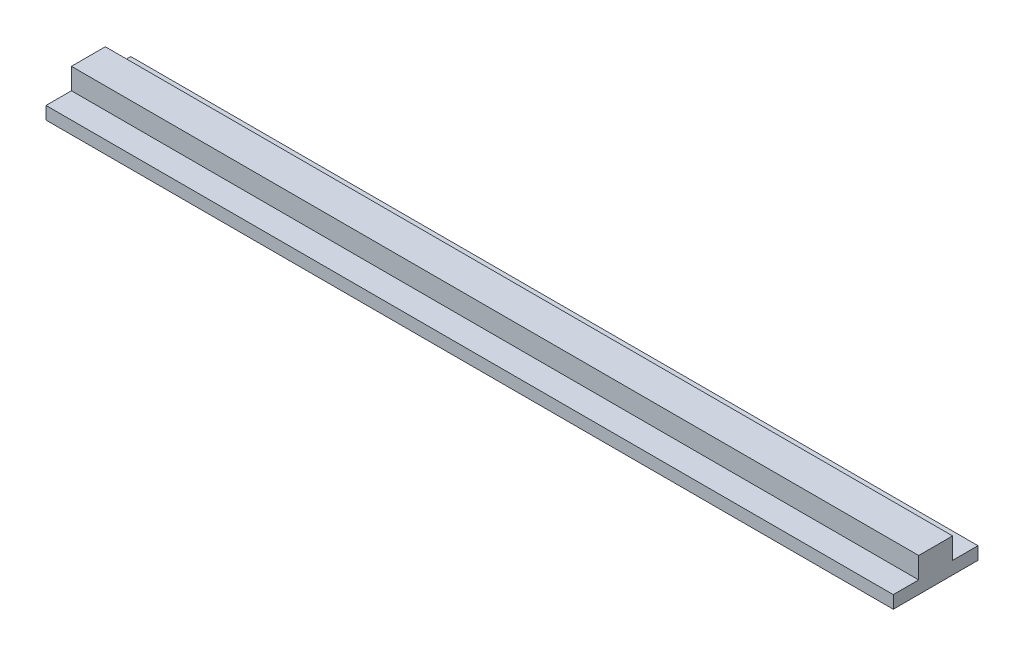
ISO-10303-21;
HEADER;
FILE_DESCRIPTION(('STEP AP214'),'2;1');
FILE_NAME('part.step','',(''),(''),'','','');
FILE_SCHEMA(('AUTOMOTIVE_DESIGN { 1 0 10303 214 1 1 1 1 }'));
ENDSEC;
DATA;
#1=APPLICATION_CONTEXT('core data for automotive mechanical design processes');
#2=APPLICATION_PROTOCOL_DEFINITION('international standard','automotive_design',2000,#1);
#3=PRODUCT_CONTEXT('',#1,'mechanical');
#4=PRODUCT('Part','Part','',(#3));
#5=PRODUCT_RELATED_PRODUCT_CATEGORY('part','',(#4));
#6=PRODUCT_DEFINITION_FORMATION('','',#4);
#7=PRODUCT_DEFINITION_CONTEXT('part definition',#1,'design');
#8=PRODUCT_DEFINITION('design','',#6,#7);
#9=PRODUCT_DEFINITION_SHAPE('','',#8);
#10=(LENGTH_UNIT() NAMED_UNIT(*) SI_UNIT(.MILLI.,.METRE.));
#11=(NAMED_UNIT(*) PLANE_ANGLE_UNIT() SI_UNIT($,.RADIAN.));
#12=(NAMED_UNIT(*) SI_UNIT($,.STERADIAN.) SOLID_ANGLE_UNIT());
#13=UNCERTAINTY_MEASURE_WITH_UNIT(LENGTH_MEASURE(1.E-05),#10,'distance_accuracy_value','');
#14=(GEOMETRIC_REPRESENTATION_CONTEXT(3) GLOBAL_UNCERTAINTY_ASSIGNED_CONTEXT((#13)) GLOBAL_UNIT_ASSIGNED_CONTEXT((#10,
#11,#12)) REPRESENTATION_CONTEXT('',''));
#15=CARTESIAN_POINT('',(0.,0.,0.));
#16=DIRECTION('',(0.,0.,1.));
#17=DIRECTION('',(1.,0.,0.));
#18=AXIS2_PLACEMENT_3D('',#15,#16,#17);
#19=CARTESIAN_POINT('',(1000.,30.,40.));
#20=DIRECTION('',(0.,-1.,0.));
#21=DIRECTION('',(0.,0.,-1.));
#22=AXIS2_PLACEMENT_3D('',#19,#20,#21);
#23=PLANE('',#22);
#24=DIRECTION('',(0.,0.,1.));
#25=VECTOR('',#24,1.);
#26=CARTESIAN_POINT('',(-1000.,30.,40.));
#27=LINE('',#26,#25);
#28=CARTESIAN_POINT('',(-1000.,30.,40.));
#29=VERTEX_POINT('',#28);
#30=CARTESIAN_POINT('',(-1000.,30.,100.));
#31=VERTEX_POINT('',#30);
#32=EDGE_CURVE('E132',#29,#31,#27,.T.);
#33=ORIENTED_EDGE('',*,*,#32,.T.);
#34=DIRECTION('',(-1.,0.,0.));
#35=VECTOR('',#34,1.);
#36=CARTESIAN_POINT('',(1000.,30.,100.));
#37=LINE('',#36,#35);
#38=CARTESIAN_POINT('',(1000.,30.,100.));
#39=VERTEX_POINT('',#38);
#40=EDGE_CURVE('E43',#39,#31,#37,.T.);
#41=ORIENTED_EDGE('',*,*,#40,.F.);
#42=DIRECTION('',(0.,0.,1.));
#43=VECTOR('',#42,1.);
#44=CARTESIAN_POINT('',(1000.,30.,40.));
#45=LINE('',#44,#43);
#46=CARTESIAN_POINT('',(1000.,30.,40.));
#47=VERTEX_POINT('',#46);
#48=EDGE_CURVE('E147',#47,#39,#45,.T.);
#49=ORIENTED_EDGE('',*,*,#48,.F.);
#50=DIRECTION('',(-1.,0.,0.));
#51=VECTOR('',#50,1.);
#52=CARTESIAN_POINT('',(1000.,30.,40.));
#53=LINE('',#52,#51);
#54=EDGE_CURVE('E128',#47,#29,#53,.T.);
#55=ORIENTED_EDGE('',*,*,#54,.T.);
#56=EDGE_LOOP('',(#33,#41,#49,#55));
#57=FACE_BOUND('',#56,.T.);
#58=ADVANCED_FACE('F35',(#57),#23,.F.);
#59=CARTESIAN_POINT('',(1000.,30.,100.));
#60=DIRECTION('',(0.,0.,-1.));
#61=DIRECTION('',(-1.,0.,0.));
#62=AXIS2_PLACEMENT_3D('',#59,#60,#61);
#63=PLANE('',#62);
#64=DIRECTION('',(0.,-1.,0.));
#65=VECTOR('',#64,1.);
#66=CARTESIAN_POINT('',(-1000.,30.,100.));
#67=LINE('',#66,#65);
#68=CARTESIAN_POINT('',(-1000.,0.,100.));
#69=VERTEX_POINT('',#68);
#70=EDGE_CURVE('E135',#31,#69,#67,.T.);
#71=ORIENTED_EDGE('',*,*,#70,.T.);
#72=DIRECTION('',(-1.,0.,0.));
#73=VECTOR('',#72,1.);
#74=CARTESIAN_POINT('',(1000.,0.,100.));
#75=LINE('',#74,#73);
#76=CARTESIAN_POINT('',(1000.,0.,100.));
#77=VERTEX_POINT('',#76);
#78=EDGE_CURVE('E157',#77,#69,#75,.T.);
#79=ORIENTED_EDGE('',*,*,#78,.F.);
#80=DIRECTION('',(0.,-1.,0.));
#81=VECTOR('',#80,1.);
#82=CARTESIAN_POINT('',(1000.,30.,100.));
#83=LINE('',#82,#81);
#84=EDGE_CURVE('E95',#39,#77,#83,.T.);
#85=ORIENTED_EDGE('',*,*,#84,.F.);
#86=ORIENTED_EDGE('',*,*,#40,.T.);
#87=EDGE_LOOP('',(#71,#79,#85,#86));
#88=FACE_BOUND('',#87,.T.);
#89=ADVANCED_FACE('F160',(#88),#63,.F.);
#90=CARTESIAN_POINT('',(1000.,0.,-100.));
#91=DIRECTION('',(0.,1.,0.));
#92=DIRECTION('',(0.,0.,1.));
#93=AXIS2_PLACEMENT_3D('',#90,#91,#92);
#94=PLANE('',#93);
#95=CARTESIAN_POINT('',(0.,0.,0.));
#96=DIRECTION('',(0.,1.,0.));
#97=DIRECTION('',(0.,0.,1.));
#98=AXIS2_PLACEMENT_3D('',#95,#96,#97);
#99=CIRCLE('',#98,20.);
#100=CARTESIAN_POINT('',(0.,0.,20.));
#101=VERTEX_POINT('',#100);
#102=EDGE_CURVE('E11',#101,#101,#99,.F.);
#103=ORIENTED_EDGE('',*,*,#102,.F.);
#104=EDGE_LOOP('',(#103));
#105=FACE_BOUND('',#104,.T.);
#106=DIRECTION('',(0.,0.,-1.));
#107=VECTOR('',#106,1.);
#108=CARTESIAN_POINT('',(-1000.,0.,-100.));
#109=LINE('',#108,#107);
#110=CARTESIAN_POINT('',(-1000.,0.,-100.));
#111=VERTEX_POINT('',#110);
#112=EDGE_CURVE('E138',#69,#111,#109,.T.);
#113=ORIENTED_EDGE('',*,*,#112,.T.);
#114=DIRECTION('',(-1.,0.,0.));
#115=VECTOR('',#114,1.);
#116=CARTESIAN_POINT('',(1000.,0.,-100.));
#117=LINE('',#116,#115);
#118=CARTESIAN_POINT('',(1000.,0.,-100.));
#119=VERTEX_POINT('',#118);
#120=EDGE_CURVE('E154',#119,#111,#117,.T.);
#121=ORIENTED_EDGE('',*,*,#120,.F.);
#122=DIRECTION('',(0.,0.,-1.));
#123=VECTOR('',#122,1.);
#124=CARTESIAN_POINT('',(1000.,0.,-100.));
#125=LINE('',#124,#123);
#126=EDGE_CURVE('E178',#77,#119,#125,.T.);
#127=ORIENTED_EDGE('',*,*,#126,.F.);
#128=ORIENTED_EDGE('',*,*,#78,.T.);
#129=EDGE_LOOP('',(#113,#121,#127,#128));
#130=FACE_BOUND('',#129,.T.);
#131=ADVANCED_FACE('F171',(#105,#130),#94,.F.);
#132=CARTESIAN_POINT('',(1000.,30.,-100.));
#133=DIRECTION('',(0.,0.,1.));
#134=DIRECTION('',(1.,0.,0.));
#135=AXIS2_PLACEMENT_3D('',#132,#133,#134);
#136=PLANE('',#135);
#137=DIRECTION('',(0.,1.,0.));
#138=VECTOR('',#137,1.);
#139=CARTESIAN_POINT('',(-1000.,30.,-100.));
#140=LINE('',#139,#138);
#141=CARTESIAN_POINT('',(-1000.,30.,-100.));
#142=VERTEX_POINT('',#141);
#143=EDGE_CURVE('E140',#111,#142,#140,.T.);
#144=ORIENTED_EDGE('',*,*,#143,.T.);
#145=DIRECTION('',(-1.,0.,0.));
#146=VECTOR('',#145,1.);
#147=CARTESIAN_POINT('',(1000.,30.,-100.));
#148=LINE('',#147,#146);
#149=CARTESIAN_POINT('',(1000.,30.,-100.));
#150=VERTEX_POINT('',#149);
#151=EDGE_CURVE('E151',#150,#142,#148,.T.);
#152=ORIENTED_EDGE('',*,*,#151,.F.);
#153=DIRECTION('',(0.,1.,0.));
#154=VECTOR('',#153,1.);
#155=CARTESIAN_POINT('',(1000.,30.,-100.));
#156=LINE('',#155,#154);
#157=EDGE_CURVE('E177',#119,#150,#156,.T.);
#158=ORIENTED_EDGE('',*,*,#157,.F.);
#159=ORIENTED_EDGE('',*,*,#120,.T.);
#160=EDGE_LOOP('',(#144,#152,#158,#159));
#161=FACE_BOUND('',#160,.T.);
#162=ADVANCED_FACE('F175',(#161),#136,.F.);
#163=CARTESIAN_POINT('',(1000.,30.,-40.));
#164=DIRECTION('',(0.,-1.,0.));
#165=DIRECTION('',(0.,0.,-1.));
#166=AXIS2_PLACEMENT_3D('',#163,#164,#165);
#167=PLANE('',#166);
#168=DIRECTION('',(0.,0.,1.));
#169=VECTOR('',#168,1.);
#170=CARTESIAN_POINT('',(-1000.,30.,-40.));
#171=LINE('',#170,#169);
#172=CARTESIAN_POINT('',(-1000.,30.,-40.));
#173=VERTEX_POINT('',#172);
#174=EDGE_CURVE('E142',#142,#173,#171,.T.);
#175=ORIENTED_EDGE('',*,*,#174,.T.);
#176=DIRECTION('',(-1.,0.,0.));
#177=VECTOR('',#176,1.);
#178=CARTESIAN_POINT('',(1000.,30.,-40.));
#179=LINE('',#178,#177);
#180=CARTESIAN_POINT('',(1000.,30.,-40.));
#181=VERTEX_POINT('',#180);
#182=EDGE_CURVE('E123',#181,#173,#179,.T.);
#183=ORIENTED_EDGE('',*,*,#182,.F.);
#184=DIRECTION('',(0.,0.,1.));
#185=VECTOR('',#184,1.);
#186=CARTESIAN_POINT('',(1000.,30.,-40.));
#187=LINE('',#186,#185);
#188=EDGE_CURVE('E114',#150,#181,#187,.T.);
#189=ORIENTED_EDGE('',*,*,#188,.F.);
#190=ORIENTED_EDGE('',*,*,#151,.T.);
#191=EDGE_LOOP('',(#175,#183,#189,#190));
#192=FACE_BOUND('',#191,.T.);
#193=ADVANCED_FACE('F201',(#192),#167,.F.);
#194=CARTESIAN_POINT('',(1000.,80.,-40.));
#195=DIRECTION('',(0.,0.,1.));
#196=DIRECTION('',(1.,0.,0.));
#197=AXIS2_PLACEMENT_3D('',#194,#195,#196);
#198=PLANE('',#197);
#199=DIRECTION('',(0.,1.,0.));
#200=VECTOR('',#199,1.);
#201=CARTESIAN_POINT('',(-1000.,80.,-40.));
#202=LINE('',#201,#200);
#203=CARTESIAN_POINT('',(-1000.,80.,-40.));
#204=VERTEX_POINT('',#203);
#205=EDGE_CURVE('E122',#173,#204,#202,.T.);
#206=ORIENTED_EDGE('',*,*,#205,.T.);
#207=DIRECTION('',(-1.,0.,0.));
#208=VECTOR('',#207,1.);
#209=CARTESIAN_POINT('',(1000.,80.,-40.));
#210=LINE('',#209,#208);
#211=CARTESIAN_POINT('',(1000.,80.,-40.));
#212=VERTEX_POINT('',#211);
#213=EDGE_CURVE('E119',#212,#204,#210,.T.);
#214=ORIENTED_EDGE('',*,*,#213,.F.);
#215=DIRECTION('',(0.,1.,0.));
#216=VECTOR('',#215,1.);
#217=CARTESIAN_POINT('',(1000.,80.,-40.));
#218=LINE('',#217,#216);
#219=EDGE_CURVE('E108',#181,#212,#218,.T.);
#220=ORIENTED_EDGE('',*,*,#219,.F.);
#221=ORIENTED_EDGE('',*,*,#182,.T.);
#222=EDGE_LOOP('',(#206,#214,#220,#221));
#223=FACE_BOUND('',#222,.T.);
#224=ADVANCED_FACE('F120',(#223),#198,.F.);
#225=CARTESIAN_POINT('',(1000.,80.,40.));
#226=DIRECTION('',(0.,-1.,0.));
#227=DIRECTION('',(0.,0.,-1.));
#228=AXIS2_PLACEMENT_3D('',#225,#226,#227);
#229=PLANE('',#228);
#230=DIRECTION('',(0.,0.,1.));
#231=VECTOR('',#230,1.);
#232=CARTESIAN_POINT('',(-1000.,80.,40.));
#233=LINE('',#232,#231);
#234=CARTESIAN_POINT('',(-1000.,80.,40.));
#235=VERTEX_POINT('',#234);
#236=EDGE_CURVE('E80',#204,#235,#233,.T.);
#237=ORIENTED_EDGE('',*,*,#236,.T.);
#238=DIRECTION('',(-1.,0.,0.));
#239=VECTOR('',#238,1.);
#240=CARTESIAN_POINT('',(1000.,80.,40.));
#241=LINE('',#240,#239);
#242=CARTESIAN_POINT('',(1000.,80.,40.));
#243=VERTEX_POINT('',#242);
#244=EDGE_CURVE('E124',#243,#235,#241,.T.);
#245=ORIENTED_EDGE('',*,*,#244,.F.);
#246=DIRECTION('',(0.,0.,1.));
#247=VECTOR('',#246,1.);
#248=CARTESIAN_POINT('',(1000.,80.,40.));
#249=LINE('',#248,#247);
#250=EDGE_CURVE('E112',#212,#243,#249,.T.);
#251=ORIENTED_EDGE('',*,*,#250,.F.);
#252=ORIENTED_EDGE('',*,*,#213,.T.);
#253=EDGE_LOOP('',(#237,#245,#251,#252));
#254=FACE_BOUND('',#253,.T.);
#255=ADVANCED_FACE('F126',(#254),#229,.F.);
#256=CARTESIAN_POINT('',(1000.,80.,40.));
#257=DIRECTION('',(0.,0.,-1.));
#258=DIRECTION('',(-1.,0.,0.));
#259=AXIS2_PLACEMENT_3D('',#256,#257,#258);
#260=PLANE('',#259);
#261=DIRECTION('',(0.,-1.,0.));
#262=VECTOR('',#261,1.);
#263=CARTESIAN_POINT('',(-1000.,80.,40.));
#264=LINE('',#263,#262);
#265=EDGE_CURVE('E86',#235,#29,#264,.T.);
#266=ORIENTED_EDGE('',*,*,#265,.T.);
#267=ORIENTED_EDGE('',*,*,#54,.F.);
#268=DIRECTION('',(0.,-1.,0.));
#269=VECTOR('',#268,1.);
#270=CARTESIAN_POINT('',(1000.,80.,40.));
#271=LINE('',#270,#269);
#272=EDGE_CURVE('E51',#243,#47,#271,.T.);
#273=ORIENTED_EDGE('',*,*,#272,.F.);
#274=ORIENTED_EDGE('',*,*,#244,.T.);
#275=EDGE_LOOP('',(#266,#267,#273,#274));
#276=FACE_BOUND('',#275,.T.);
#277=ADVANCED_FACE('F243',(#276),#260,.F.);
#278=CARTESIAN_POINT('',(1000.,0.,0.));
#279=DIRECTION('',(1.,0.,0.));
#280=DIRECTION('',(0.,0.,-1.));
#281=AXIS2_PLACEMENT_3D('',#278,#279,#280);
#282=PLANE('',#281);
#283=ORIENTED_EDGE('',*,*,#48,.T.);
#284=ORIENTED_EDGE('',*,*,#84,.T.);
#285=ORIENTED_EDGE('',*,*,#126,.T.);
#286=ORIENTED_EDGE('',*,*,#157,.T.);
#287=ORIENTED_EDGE('',*,*,#188,.T.);
#288=ORIENTED_EDGE('',*,*,#219,.T.);
#289=ORIENTED_EDGE('',*,*,#250,.T.);
#290=ORIENTED_EDGE('',*,*,#272,.T.);
#291=EDGE_LOOP('',(#283,#284,#285,#286,#287,#288,#289,#290));
#292=FACE_BOUND('',#291,.T.);
#293=ADVANCED_FACE('F110',(#292),#282,.T.);
#294=CARTESIAN_POINT('',(-1000.,0.,0.));
#295=DIRECTION('',(1.,0.,0.));
#296=DIRECTION('',(0.,0.,-1.));
#297=AXIS2_PLACEMENT_3D('',#294,#295,#296);
#298=PLANE('',#297);
#299=ORIENTED_EDGE('',*,*,#32,.F.);
#300=ORIENTED_EDGE('',*,*,#265,.F.);
#301=ORIENTED_EDGE('',*,*,#236,.F.);
#302=ORIENTED_EDGE('',*,*,#205,.F.);
#303=ORIENTED_EDGE('',*,*,#174,.F.);
#304=ORIENTED_EDGE('',*,*,#143,.F.);
#305=ORIENTED_EDGE('',*,*,#112,.F.);
#306=ORIENTED_EDGE('',*,*,#70,.F.);
#307=EDGE_LOOP('',(#299,#300,#301,#302,#303,#304,#305,#306));
#308=FACE_BOUND('',#307,.T.);
#309=ADVANCED_FACE('F165',(#308),#298,.F.);
#310=CARTESIAN_POINT('',(0.,-30.,0.));
#311=DIRECTION('',(0.,1.,0.));
#312=DIRECTION('',(0.,0.,1.));
#313=AXIS2_PLACEMENT_3D('',#310,#311,#312);
#314=CYLINDRICAL_SURFACE('',#313,20.);
#315=CARTESIAN_POINT('',(0.,-30.,0.));
#316=DIRECTION('',(0.,-1.,0.));
#317=DIRECTION('',(0.,0.,-1.));
#318=AXIS2_PLACEMENT_3D('',#315,#316,#317);
#319=CIRCLE('',#318,20.);
#320=CARTESIAN_POINT('',(0.,-30.,-20.));
#321=VERTEX_POINT('',#320);
#322=EDGE_CURVE('E136',#321,#321,#319,.T.);
#323=ORIENTED_EDGE('',*,*,#322,.F.);
#324=EDGE_LOOP('',(#323));
#325=FACE_BOUND('',#324,.T.);
#326=ORIENTED_EDGE('',*,*,#102,.T.);
#327=EDGE_LOOP('',(#326));
#328=FACE_BOUND('',#327,.T.);
#329=ADVANCED_FACE('F189',(#325,#328),#314,.T.);
#330=CARTESIAN_POINT('',(0.,-30.,0.));
#331=DIRECTION('',(0.,-1.,0.));
#332=DIRECTION('',(0.,0.,-1.));
#333=AXIS2_PLACEMENT_3D('',#330,#331,#332);
#334=PLANE('',#333);
#335=ORIENTED_EDGE('',*,*,#322,.T.);
#336=EDGE_LOOP('',(#335));
#337=FACE_BOUND('',#336,.T.);
#338=ADVANCED_FACE('F187',(#337),#334,.T.);
#339=CLOSED_SHELL('',(#58,#89,#131,#162,#193,#224,#255,#277,#293,#309,#329,#338));
#340=MANIFOLD_SOLID_BREP('B2',#339);
#341=ADVANCED_BREP_SHAPE_REPRESENTATION('',(#18,#340),#14);
#342=SHAPE_DEFINITION_REPRESENTATION(#9,#341);
ENDSEC;
END-ISO-10303-21;
